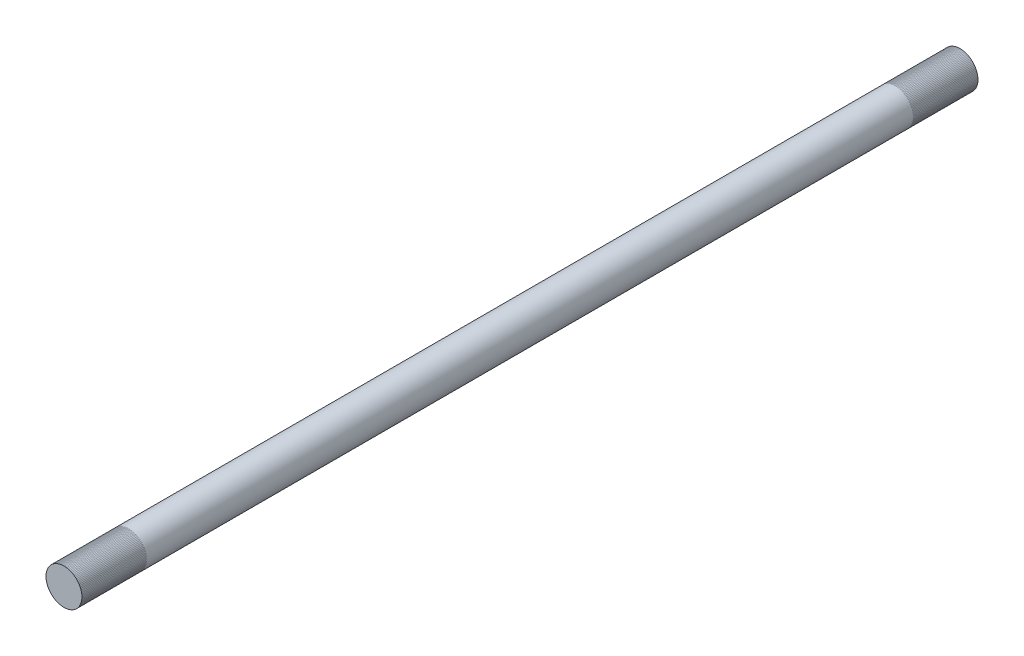
ISO-10303-21;
HEADER;
FILE_DESCRIPTION(('STEP AP214'),'2;1');
FILE_NAME('part.step','',(''),(''),'','','');
FILE_SCHEMA(('AUTOMOTIVE_DESIGN { 1 0 10303 214 1 1 1 1 }'));
ENDSEC;
DATA;
#1=APPLICATION_CONTEXT('core data for automotive mechanical design processes');
#2=APPLICATION_PROTOCOL_DEFINITION('international standard','automotive_design',2000,#1);
#3=PRODUCT_CONTEXT('',#1,'mechanical');
#4=PRODUCT('Part','Part','',(#3));
#5=PRODUCT_RELATED_PRODUCT_CATEGORY('part','',(#4));
#6=PRODUCT_DEFINITION_FORMATION('','',#4);
#7=PRODUCT_DEFINITION_CONTEXT('part definition',#1,'design');
#8=PRODUCT_DEFINITION('design','',#6,#7);
#9=PRODUCT_DEFINITION_SHAPE('','',#8);
#10=(LENGTH_UNIT() NAMED_UNIT(*) SI_UNIT(.MILLI.,.METRE.));
#11=(NAMED_UNIT(*) PLANE_ANGLE_UNIT() SI_UNIT($,.RADIAN.));
#12=(NAMED_UNIT(*) SI_UNIT($,.STERADIAN.) SOLID_ANGLE_UNIT());
#13=UNCERTAINTY_MEASURE_WITH_UNIT(LENGTH_MEASURE(1.E-05),#10,'distance_accuracy_value','');
#14=(GEOMETRIC_REPRESENTATION_CONTEXT(3) GLOBAL_UNCERTAINTY_ASSIGNED_CONTEXT((#13)) GLOBAL_UNIT_ASSIGNED_CONTEXT((#10,
#11,#12)) REPRESENTATION_CONTEXT('',''));
#15=CARTESIAN_POINT('',(0.,0.,0.));
#16=DIRECTION('',(0.,0.,1.));
#17=DIRECTION('',(1.,0.,0.));
#18=AXIS2_PLACEMENT_3D('',#15,#16,#17);
#19=CARTESIAN_POINT('',(0.,-2.66931948834931E-13,-40.8205122421382));
#20=DIRECTION('',(0.,0.,1.));
#21=DIRECTION('',(1.,0.,0.));
#22=AXIS2_PLACEMENT_3D('',#19,#20,#21);
#23=CYLINDRICAL_SURFACE('',#22,6.34999999999999);
#24=CARTESIAN_POINT('',(0.,-2.66931948834931E-13,-22.86));
#25=DIRECTION('',(0.,0.,1.));
#26=DIRECTION('',(1.,0.,0.));
#27=AXIS2_PLACEMENT_3D('',#24,#25,#26);
#28=CIRCLE('',#27,6.34999999999999);
#29=CARTESIAN_POINT('',(6.34999999999993,-2.66931948834931E-13,-22.86));
#30=VERTEX_POINT('',#29);
#31=EDGE_CURVE('E11',#30,#30,#28,.F.);
#32=ORIENTED_EDGE('',*,*,#31,.F.);
#33=EDGE_LOOP('',(#32));
#34=FACE_BOUND('',#33,.T.);
#35=CARTESIAN_POINT('',(0.,-2.66931948834931E-13,293.85006));
#36=DIRECTION('',(0.,0.,1.));
#37=DIRECTION('',(1.,0.,0.));
#38=AXIS2_PLACEMENT_3D('',#35,#36,#37);
#39=CIRCLE('',#38,6.34999999999999);
#40=CARTESIAN_POINT('',(6.34999999999993,-2.66931948834931E-13,293.85006));
#41=VERTEX_POINT('',#40);
#42=EDGE_CURVE('E50',#41,#41,#39,.T.);
#43=ORIENTED_EDGE('',*,*,#42,.F.);
#44=EDGE_LOOP('',(#43));
#45=FACE_BOUND('',#44,.T.);
#46=ADVANCED_FACE('F44',(#34,#45),#23,.T.);
#47=CARTESIAN_POINT('',(0.,-2.66931948834931E-13,293.85006));
#48=DIRECTION('',(0.,0.,1.));
#49=DIRECTION('',(1.,0.,0.));
#50=AXIS2_PLACEMENT_3D('',#47,#48,#49);
#51=PLANE('',#50);
#52=ORIENTED_EDGE('',*,*,#42,.T.);
#53=EDGE_LOOP('',(#52));
#54=FACE_BOUND('',#53,.T.);
#55=ADVANCED_FACE('F56',(#54),#51,.T.);
#56=CARTESIAN_POINT('',(0.,0.,-22.86));
#57=DIRECTION('',(0.,0.,1.));
#58=DIRECTION('',(1.,0.,0.));
#59=AXIS2_PLACEMENT_3D('',#56,#57,#58);
#60=PLANE('',#59);
#61=ORIENTED_EDGE('',*,*,#31,.T.);
#62=EDGE_LOOP('',(#61));
#63=FACE_BOUND('',#62,.T.);
#64=ADVANCED_FACE('F63',(#63),#60,.F.);
#65=CLOSED_SHELL('',(#46,#55,#64));
#66=MANIFOLD_SOLID_BREP('B2',#65);
#67=CARTESIAN_POINT('',(0.,-2.7224385249561E-13,282.42006));
#68=DIRECTION('',(0.,0.,1.));
#69=DIRECTION('',(-0.708695075936753,0.70551491078715,0.));
#70=AXIS2_PLACEMENT_3D('',#67,#68,#69);
#71=CYLINDRICAL_SURFACE('',#70,6.35);
#72=CARTESIAN_POINT('',(0.,-2.77555756156289E-13,270.99006));
#73=DIRECTION('',(0.,0.,1.));
#74=DIRECTION('',(-0.708695075936753,0.70551491078715,0.));
#75=AXIS2_PLACEMENT_3D('',#72,#73,#74);
#76=CIRCLE('',#75,6.35);
#77=CARTESIAN_POINT('',(-4.50021373219843,4.48001968349813,270.99006));
#78=VERTEX_POINT('',#77);
#79=EDGE_CURVE('E96',#78,#78,#76,.T.);
#80=ORIENTED_EDGE('',*,*,#79,.F.);
#81=EDGE_LOOP('',(#80));
#82=FACE_BOUND('',#81,.T.);
#83=CARTESIAN_POINT('',(0.,-2.66931948834931E-13,293.85006));
#84=DIRECTION('',(0.,0.,1.));
#85=DIRECTION('',(-0.708695075936753,0.70551491078715,0.));
#86=AXIS2_PLACEMENT_3D('',#83,#84,#85);
#87=CIRCLE('',#86,6.35);
#88=CARTESIAN_POINT('',(-4.50021373219844,4.48001968349814,293.85006));
#89=VERTEX_POINT('',#88);
#90=EDGE_CURVE('E43',#89,#89,#87,.F.);
#91=ORIENTED_EDGE('',*,*,#90,.F.);
#92=EDGE_LOOP('',(#91));
#93=FACE_BOUND('',#92,.T.);
#94=ADVANCED_FACE('F92',(#82,#93),#71,.F.);
#95=OPEN_SHELL('',(#94));
#96=SHELL_BASED_SURFACE_MODEL('B6',(#95));
#97=CARTESIAN_POINT('',(0.,1.19707799228763E-13,-11.43));
#98=DIRECTION('',(0.,0.,-1.));
#99=DIRECTION('',(-1.,0.,0.));
#100=AXIS2_PLACEMENT_3D('',#97,#98,#99);
#101=CYLINDRICAL_SURFACE('',#100,6.35);
#102=CARTESIAN_POINT('',(0.,1.1716982939447E-13,-22.86));
#103=DIRECTION('',(0.,0.,-1.));
#104=DIRECTION('',(-1.,0.,0.));
#105=AXIS2_PLACEMENT_3D('',#102,#103,#104);
#106=CIRCLE('',#105,6.35);
#107=CARTESIAN_POINT('',(-6.34999999999995,1.1716982939447E-13,-22.86));
#108=VERTEX_POINT('',#107);
#109=EDGE_CURVE('E133',#108,#108,#106,.T.);
#110=ORIENTED_EDGE('',*,*,#109,.T.);
#111=EDGE_LOOP('',(#110));
#112=FACE_BOUND('',#111,.T.);
#113=CARTESIAN_POINT('',(0.,1.22245769063056E-13,0.));
#114=DIRECTION('',(0.,0.,-1.));
#115=DIRECTION('',(-1.,0.,0.));
#116=AXIS2_PLACEMENT_3D('',#113,#114,#115);
#117=CIRCLE('',#116,6.35);
#118=CARTESIAN_POINT('',(-6.34999999999996,1.22245769063056E-13,0.));
#119=VERTEX_POINT('',#118);
#120=EDGE_CURVE('E91',#119,#119,#117,.T.);
#121=ORIENTED_EDGE('',*,*,#120,.F.);
#122=EDGE_LOOP('',(#121));
#123=FACE_BOUND('',#122,.T.);
#124=ADVANCED_FACE('F129',(#112,#123),#101,.F.);
#125=OPEN_SHELL('',(#124));
#126=SHELL_BASED_SURFACE_MODEL('B38',(#125));
#127=ADVANCED_BREP_SHAPE_REPRESENTATION('',(#18,#66),#14);
#128=MANIFOLD_SURFACE_SHAPE_REPRESENTATION('',(#18,#96,#126),#14);
#129=SHAPE_REPRESENTATION('',(#18),#14);
#130=SHAPE_DEFINITION_REPRESENTATION(#9,#129);
#131=SHAPE_REPRESENTATION_RELATIONSHIP('','',#129,#127);
#132=SHAPE_REPRESENTATION_RELATIONSHIP('','',#129,#128);
ENDSEC;
END-ISO-10303-21;
